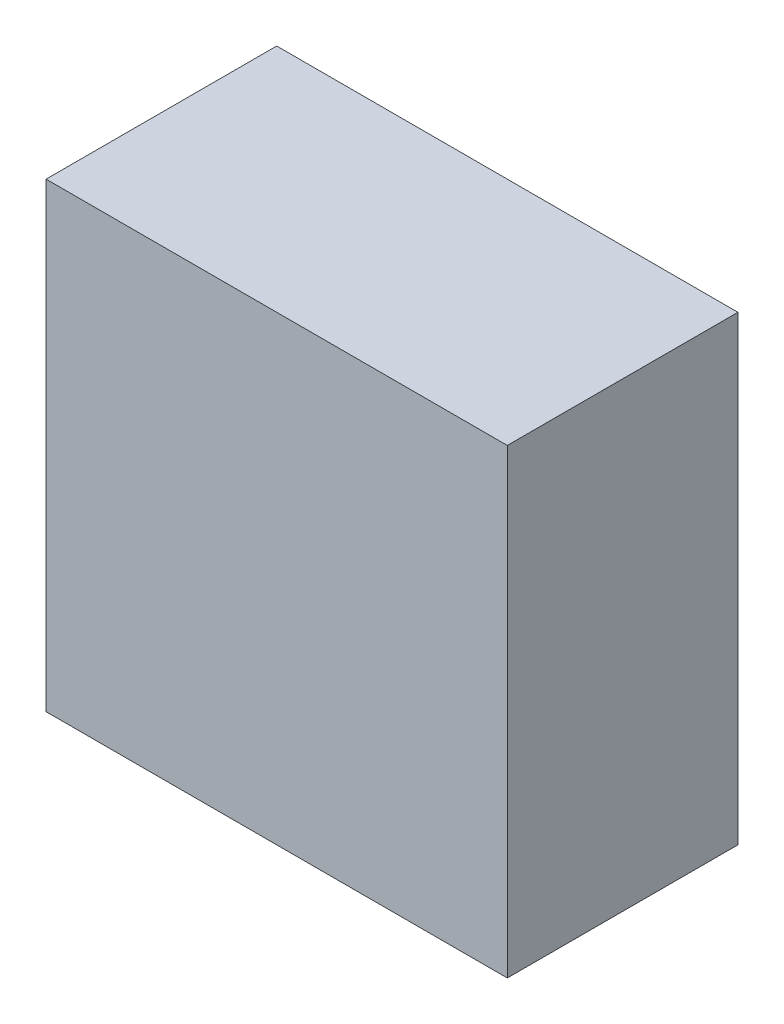
ISO-10303-21;
HEADER;
FILE_DESCRIPTION(('STEP AP214'),'2;1');
FILE_NAME('part.step','',(''),(''),'','','');
FILE_SCHEMA(('AUTOMOTIVE_DESIGN { 1 0 10303 214 1 1 1 1 }'));
ENDSEC;
DATA;
#1=APPLICATION_CONTEXT('core data for automotive mechanical design processes');
#2=APPLICATION_PROTOCOL_DEFINITION('international standard','automotive_design',2000,#1);
#3=PRODUCT_CONTEXT('',#1,'mechanical');
#4=PRODUCT('Part','Part','',(#3));
#5=PRODUCT_RELATED_PRODUCT_CATEGORY('part','',(#4));
#6=PRODUCT_DEFINITION_FORMATION('','',#4);
#7=PRODUCT_DEFINITION_CONTEXT('part definition',#1,'design');
#8=PRODUCT_DEFINITION('design','',#6,#7);
#9=PRODUCT_DEFINITION_SHAPE('','',#8);
#10=(LENGTH_UNIT() NAMED_UNIT(*) SI_UNIT(.MILLI.,.METRE.));
#11=(NAMED_UNIT(*) PLANE_ANGLE_UNIT() SI_UNIT($,.RADIAN.));
#12=(NAMED_UNIT(*) SI_UNIT($,.STERADIAN.) SOLID_ANGLE_UNIT());
#13=UNCERTAINTY_MEASURE_WITH_UNIT(LENGTH_MEASURE(1.E-05),#10,'distance_accuracy_value','');
#14=(GEOMETRIC_REPRESENTATION_CONTEXT(3) GLOBAL_UNCERTAINTY_ASSIGNED_CONTEXT((#13)) GLOBAL_UNIT_ASSIGNED_CONTEXT((#10,
#11,#12)) REPRESENTATION_CONTEXT('',''));
#15=CARTESIAN_POINT('',(0.,0.,0.));
#16=DIRECTION('',(0.,0.,1.));
#17=DIRECTION('',(1.,0.,0.));
#18=AXIS2_PLACEMENT_3D('',#15,#16,#17);
#19=CARTESIAN_POINT('',(-30.,-30.,30.));
#20=DIRECTION('',(1.,0.,0.));
#21=DIRECTION('',(0.,0.,-1.));
#22=AXIS2_PLACEMENT_3D('',#19,#20,#21);
#23=PLANE('',#22);
#24=DIRECTION('',(0.,-1.,0.));
#25=VECTOR('',#24,1.);
#26=CARTESIAN_POINT('',(-30.,-30.,0.));
#27=LINE('',#26,#25);
#28=CARTESIAN_POINT('',(-30.,30.,0.));
#29=VERTEX_POINT('',#28);
#30=CARTESIAN_POINT('',(-30.,-30.,0.));
#31=VERTEX_POINT('',#30);
#32=EDGE_CURVE('E109',#29,#31,#27,.T.);
#33=ORIENTED_EDGE('',*,*,#32,.T.);
#34=DIRECTION('',(0.,0.,-1.));
#35=VECTOR('',#34,1.);
#36=CARTESIAN_POINT('',(-30.,-30.,30.));
#37=LINE('',#36,#35);
#38=CARTESIAN_POINT('',(-30.,-30.,30.));
#39=VERTEX_POINT('',#38);
#40=EDGE_CURVE('E11',#39,#31,#37,.T.);
#41=ORIENTED_EDGE('',*,*,#40,.F.);
#42=DIRECTION('',(0.,-1.,0.));
#43=VECTOR('',#42,1.);
#44=CARTESIAN_POINT('',(-30.,-30.,30.));
#45=LINE('',#44,#43);
#46=CARTESIAN_POINT('',(-30.,30.,30.));
#47=VERTEX_POINT('',#46);
#48=EDGE_CURVE('E93',#47,#39,#45,.T.);
#49=ORIENTED_EDGE('',*,*,#48,.F.);
#50=DIRECTION('',(0.,0.,-1.));
#51=VECTOR('',#50,1.);
#52=CARTESIAN_POINT('',(-30.,30.,30.));
#53=LINE('',#52,#51);
#54=EDGE_CURVE('E105',#47,#29,#53,.T.);
#55=ORIENTED_EDGE('',*,*,#54,.T.);
#56=EDGE_LOOP('',(#33,#41,#49,#55));
#57=FACE_BOUND('',#56,.T.);
#58=ADVANCED_FACE('F41',(#57),#23,.F.);
#59=CARTESIAN_POINT('',(30.,-30.,30.));
#60=DIRECTION('',(0.,1.,0.));
#61=DIRECTION('',(-1.,0.,0.));
#62=AXIS2_PLACEMENT_3D('',#59,#60,#61);
#63=PLANE('',#62);
#64=DIRECTION('',(1.,0.,0.));
#65=VECTOR('',#64,1.);
#66=CARTESIAN_POINT('',(30.,-30.,0.));
#67=LINE('',#66,#65);
#68=CARTESIAN_POINT('',(30.,-30.,0.));
#69=VERTEX_POINT('',#68);
#70=EDGE_CURVE('E98',#31,#69,#67,.T.);
#71=ORIENTED_EDGE('',*,*,#70,.T.);
#72=DIRECTION('',(0.,0.,-1.));
#73=VECTOR('',#72,1.);
#74=CARTESIAN_POINT('',(30.,-30.,30.));
#75=LINE('',#74,#73);
#76=CARTESIAN_POINT('',(30.,-30.,30.));
#77=VERTEX_POINT('',#76);
#78=EDGE_CURVE('E50',#77,#69,#75,.T.);
#79=ORIENTED_EDGE('',*,*,#78,.F.);
#80=DIRECTION('',(1.,0.,0.));
#81=VECTOR('',#80,1.);
#82=CARTESIAN_POINT('',(30.,-30.,30.));
#83=LINE('',#82,#81);
#84=EDGE_CURVE('E88',#39,#77,#83,.T.);
#85=ORIENTED_EDGE('',*,*,#84,.F.);
#86=ORIENTED_EDGE('',*,*,#40,.T.);
#87=EDGE_LOOP('',(#71,#79,#85,#86));
#88=FACE_BOUND('',#87,.T.);
#89=ADVANCED_FACE('F97',(#88),#63,.F.);
#90=CARTESIAN_POINT('',(30.,-30.,30.));
#91=DIRECTION('',(-1.,0.,0.));
#92=DIRECTION('',(0.,0.,1.));
#93=AXIS2_PLACEMENT_3D('',#90,#91,#92);
#94=PLANE('',#93);
#95=DIRECTION('',(0.,1.,0.));
#96=VECTOR('',#95,1.);
#97=CARTESIAN_POINT('',(30.,-30.,0.));
#98=LINE('',#97,#96);
#99=CARTESIAN_POINT('',(30.,30.,0.));
#100=VERTEX_POINT('',#99);
#101=EDGE_CURVE('E75',#69,#100,#98,.T.);
#102=ORIENTED_EDGE('',*,*,#101,.T.);
#103=DIRECTION('',(0.,0.,-1.));
#104=VECTOR('',#103,1.);
#105=CARTESIAN_POINT('',(30.,30.,30.));
#106=LINE('',#105,#104);
#107=CARTESIAN_POINT('',(30.,30.,30.));
#108=VERTEX_POINT('',#107);
#109=EDGE_CURVE('E100',#108,#100,#106,.T.);
#110=ORIENTED_EDGE('',*,*,#109,.F.);
#111=DIRECTION('',(0.,1.,0.));
#112=VECTOR('',#111,1.);
#113=CARTESIAN_POINT('',(30.,-30.,30.));
#114=LINE('',#113,#112);
#115=EDGE_CURVE('E91',#77,#108,#114,.T.);
#116=ORIENTED_EDGE('',*,*,#115,.F.);
#117=ORIENTED_EDGE('',*,*,#78,.T.);
#118=EDGE_LOOP('',(#102,#110,#116,#117));
#119=FACE_BOUND('',#118,.T.);
#120=ADVANCED_FACE('F101',(#119),#94,.F.);
#121=CARTESIAN_POINT('',(30.,30.,30.));
#122=DIRECTION('',(0.,-1.,0.));
#123=DIRECTION('',(1.,0.,0.));
#124=AXIS2_PLACEMENT_3D('',#121,#122,#123);
#125=PLANE('',#124);
#126=DIRECTION('',(-1.,0.,0.));
#127=VECTOR('',#126,1.);
#128=CARTESIAN_POINT('',(30.,30.,0.));
#129=LINE('',#128,#127);
#130=EDGE_CURVE('E81',#100,#29,#129,.T.);
#131=ORIENTED_EDGE('',*,*,#130,.T.);
#132=ORIENTED_EDGE('',*,*,#54,.F.);
#133=DIRECTION('',(-1.,0.,0.));
#134=VECTOR('',#133,1.);
#135=CARTESIAN_POINT('',(30.,30.,30.));
#136=LINE('',#135,#134);
#137=EDGE_CURVE('E58',#108,#47,#136,.T.);
#138=ORIENTED_EDGE('',*,*,#137,.F.);
#139=ORIENTED_EDGE('',*,*,#109,.T.);
#140=EDGE_LOOP('',(#131,#132,#138,#139));
#141=FACE_BOUND('',#140,.T.);
#142=ADVANCED_FACE('F122',(#141),#125,.F.);
#143=CARTESIAN_POINT('',(0.,0.,30.));
#144=DIRECTION('',(0.,0.,1.));
#145=DIRECTION('',(1.,0.,0.));
#146=AXIS2_PLACEMENT_3D('',#143,#144,#145);
#147=PLANE('',#146);
#148=ORIENTED_EDGE('',*,*,#48,.T.);
#149=ORIENTED_EDGE('',*,*,#84,.T.);
#150=ORIENTED_EDGE('',*,*,#115,.T.);
#151=ORIENTED_EDGE('',*,*,#137,.T.);
#152=EDGE_LOOP('',(#148,#149,#150,#151));
#153=FACE_BOUND('',#152,.T.);
#154=ADVANCED_FACE('F89',(#153),#147,.T.);
#155=CARTESIAN_POINT('',(0.,0.,0.));
#156=DIRECTION('',(0.,0.,1.));
#157=DIRECTION('',(1.,0.,0.));
#158=AXIS2_PLACEMENT_3D('',#155,#156,#157);
#159=PLANE('',#158);
#160=ORIENTED_EDGE('',*,*,#32,.F.);
#161=ORIENTED_EDGE('',*,*,#130,.F.);
#162=ORIENTED_EDGE('',*,*,#101,.F.);
#163=ORIENTED_EDGE('',*,*,#70,.F.);
#164=EDGE_LOOP('',(#160,#161,#162,#163));
#165=FACE_BOUND('',#164,.T.);
#166=ADVANCED_FACE('F125',(#165),#159,.F.);
#167=CLOSED_SHELL('',(#58,#89,#120,#142,#154,#166));
#168=MANIFOLD_SOLID_BREP('B2',#167);
#169=ADVANCED_BREP_SHAPE_REPRESENTATION('',(#18,#168),#14);
#170=SHAPE_DEFINITION_REPRESENTATION(#9,#169);
ENDSEC;
END-ISO-10303-21;
